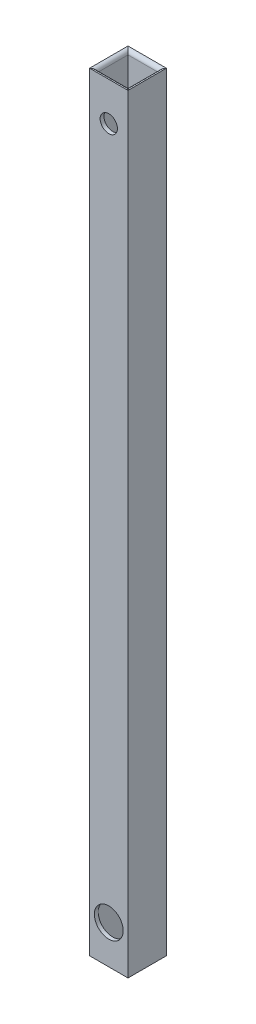
ISO-10303-21;
HEADER;
FILE_DESCRIPTION(('STEP AP214'),'2;1');
FILE_NAME('part.step','',(''),(''),'','','');
FILE_SCHEMA(('AUTOMOTIVE_DESIGN { 1 0 10303 214 1 1 1 1 }'));
ENDSEC;
DATA;
#1=APPLICATION_CONTEXT('core data for automotive mechanical design processes');
#2=APPLICATION_PROTOCOL_DEFINITION('international standard','automotive_design',2000,#1);
#3=PRODUCT_CONTEXT('',#1,'mechanical');
#4=PRODUCT('Part','Part','',(#3));
#5=PRODUCT_RELATED_PRODUCT_CATEGORY('part','',(#4));
#6=PRODUCT_DEFINITION_FORMATION('','',#4);
#7=PRODUCT_DEFINITION_CONTEXT('part definition',#1,'design');
#8=PRODUCT_DEFINITION('design','',#6,#7);
#9=PRODUCT_DEFINITION_SHAPE('','',#8);
#10=(LENGTH_UNIT() NAMED_UNIT(*) SI_UNIT(.MILLI.,.METRE.));
#11=(NAMED_UNIT(*) PLANE_ANGLE_UNIT() SI_UNIT($,.RADIAN.));
#12=(NAMED_UNIT(*) SI_UNIT($,.STERADIAN.) SOLID_ANGLE_UNIT());
#13=UNCERTAINTY_MEASURE_WITH_UNIT(LENGTH_MEASURE(1.E-05),#10,'distance_accuracy_value','');
#14=(GEOMETRIC_REPRESENTATION_CONTEXT(3) GLOBAL_UNCERTAINTY_ASSIGNED_CONTEXT((#13)) GLOBAL_UNIT_ASSIGNED_CONTEXT((#10,
#11,#12)) REPRESENTATION_CONTEXT('',''));
#15=CARTESIAN_POINT('',(0.,0.,0.));
#16=DIRECTION('',(0.,0.,1.));
#17=DIRECTION('',(1.,0.,0.));
#18=AXIS2_PLACEMENT_3D('',#15,#16,#17);
#19=CARTESIAN_POINT('',(5.,200.,-5.));
#20=DIRECTION('',(-1.,0.,0.));
#21=DIRECTION('',(0.,0.,1.));
#22=AXIS2_PLACEMENT_3D('',#19,#20,#21);
#23=PLANE('',#22);
#24=DIRECTION('',(0.,0.,-1.));
#25=VECTOR('',#24,1.);
#26=CARTESIAN_POINT('',(5.,0.,-5.));
#27=LINE('',#26,#25);
#28=CARTESIAN_POINT('',(5.,0.,5.));
#29=VERTEX_POINT('',#28);
#30=CARTESIAN_POINT('',(5.,0.,-5.));
#31=VERTEX_POINT('',#30);
#32=EDGE_CURVE('E122',#29,#31,#27,.T.);
#33=ORIENTED_EDGE('',*,*,#32,.T.);
#34=DIRECTION('',(0.,-1.,0.));
#35=VECTOR('',#34,1.);
#36=CARTESIAN_POINT('',(5.,200.,-5.));
#37=LINE('',#36,#35);
#38=CARTESIAN_POINT('',(5.,200.,-5.));
#39=VERTEX_POINT('',#38);
#40=EDGE_CURVE('E108',#39,#31,#37,.T.);
#41=ORIENTED_EDGE('',*,*,#40,.F.);
#42=DIRECTION('',(0.,0.,-1.));
#43=VECTOR('',#42,1.);
#44=CARTESIAN_POINT('',(5.,200.,-5.));
#45=LINE('',#44,#43);
#46=CARTESIAN_POINT('',(5.,200.,5.));
#47=VERTEX_POINT('',#46);
#48=EDGE_CURVE('E116',#47,#39,#45,.T.);
#49=ORIENTED_EDGE('',*,*,#48,.F.);
#50=DIRECTION('',(0.,-1.,0.));
#51=VECTOR('',#50,1.);
#52=CARTESIAN_POINT('',(5.,200.,5.));
#53=LINE('',#52,#51);
#54=EDGE_CURVE('E184',#47,#29,#53,.T.);
#55=ORIENTED_EDGE('',*,*,#54,.T.);
#56=EDGE_LOOP('',(#33,#41,#49,#55));
#57=FACE_BOUND('',#56,.T.);
#58=ADVANCED_FACE('F37',(#57),#23,.F.);
#59=CARTESIAN_POINT('',(-5.,200.,-5.));
#60=DIRECTION('',(0.,0.,1.));
#61=DIRECTION('',(1.,0.,0.));
#62=AXIS2_PLACEMENT_3D('',#59,#60,#61);
#63=PLANE('',#62);
#64=CARTESIAN_POINT('',(0.,10.,-5.));
#65=DIRECTION('',(0.,0.,1.));
#66=DIRECTION('',(1.,0.,0.));
#67=AXIS2_PLACEMENT_3D('',#64,#65,#66);
#68=CIRCLE('',#67,3.75);
#69=CARTESIAN_POINT('',(3.75,10.,-5.));
#70=VERTEX_POINT('',#69);
#71=EDGE_CURVE('E151',#70,#70,#68,.T.);
#72=ORIENTED_EDGE('',*,*,#71,.T.);
#73=EDGE_LOOP('',(#72));
#74=FACE_BOUND('',#73,.T.);
#75=CARTESIAN_POINT('',(0.,190.,-5.));
#76=DIRECTION('',(0.,0.,1.));
#77=DIRECTION('',(1.,0.,0.));
#78=AXIS2_PLACEMENT_3D('',#75,#76,#77);
#79=CIRCLE('',#78,2.25);
#80=CARTESIAN_POINT('',(2.25,190.,-5.));
#81=VERTEX_POINT('',#80);
#82=EDGE_CURVE('E167',#81,#81,#79,.T.);
#83=ORIENTED_EDGE('',*,*,#82,.T.);
#84=EDGE_LOOP('',(#83));
#85=FACE_BOUND('',#84,.T.);
#86=DIRECTION('',(-1.,0.,0.));
#87=VECTOR('',#86,1.);
#88=CARTESIAN_POINT('',(-5.,0.,-5.));
#89=LINE('',#88,#87);
#90=CARTESIAN_POINT('',(-5.,0.,-5.));
#91=VERTEX_POINT('',#90);
#92=EDGE_CURVE('E186',#31,#91,#89,.T.);
#93=ORIENTED_EDGE('',*,*,#92,.T.);
#94=DIRECTION('',(0.,-1.,0.));
#95=VECTOR('',#94,1.);
#96=CARTESIAN_POINT('',(-5.,200.,-5.));
#97=LINE('',#96,#95);
#98=CARTESIAN_POINT('',(-5.,200.,-5.));
#99=VERTEX_POINT('',#98);
#100=EDGE_CURVE('E111',#99,#91,#97,.T.);
#101=ORIENTED_EDGE('',*,*,#100,.F.);
#102=DIRECTION('',(-1.,0.,0.));
#103=VECTOR('',#102,1.);
#104=CARTESIAN_POINT('',(-5.,200.,-5.));
#105=LINE('',#104,#103);
#106=EDGE_CURVE('E105',#39,#99,#105,.T.);
#107=ORIENTED_EDGE('',*,*,#106,.F.);
#108=ORIENTED_EDGE('',*,*,#40,.T.);
#109=EDGE_LOOP('',(#93,#101,#107,#108));
#110=FACE_BOUND('',#109,.T.);
#111=ADVANCED_FACE('F107',(#74,#85,#110),#63,.F.);
#112=CARTESIAN_POINT('',(-5.,200.,-5.));
#113=DIRECTION('',(1.,0.,0.));
#114=DIRECTION('',(0.,0.,-1.));
#115=AXIS2_PLACEMENT_3D('',#112,#113,#114);
#116=PLANE('',#115);
#117=DIRECTION('',(0.,0.,1.));
#118=VECTOR('',#117,1.);
#119=CARTESIAN_POINT('',(-5.,0.,-5.));
#120=LINE('',#119,#118);
#121=CARTESIAN_POINT('',(-5.,0.,5.));
#122=VERTEX_POINT('',#121);
#123=EDGE_CURVE('E188',#91,#122,#120,.T.);
#124=ORIENTED_EDGE('',*,*,#123,.T.);
#125=DIRECTION('',(0.,-1.,0.));
#126=VECTOR('',#125,1.);
#127=CARTESIAN_POINT('',(-5.,200.,5.));
#128=LINE('',#127,#126);
#129=CARTESIAN_POINT('',(-5.,200.,5.));
#130=VERTEX_POINT('',#129);
#131=EDGE_CURVE('E193',#130,#122,#128,.T.);
#132=ORIENTED_EDGE('',*,*,#131,.F.);
#133=DIRECTION('',(0.,0.,1.));
#134=VECTOR('',#133,1.);
#135=CARTESIAN_POINT('',(-5.,200.,-5.));
#136=LINE('',#135,#134);
#137=EDGE_CURVE('E115',#99,#130,#136,.T.);
#138=ORIENTED_EDGE('',*,*,#137,.F.);
#139=ORIENTED_EDGE('',*,*,#100,.T.);
#140=EDGE_LOOP('',(#124,#132,#138,#139));
#141=FACE_BOUND('',#140,.T.);
#142=ADVANCED_FACE('F247',(#141),#116,.F.);
#143=CARTESIAN_POINT('',(-5.,200.,5.));
#144=DIRECTION('',(0.,0.,-1.));
#145=DIRECTION('',(-1.,0.,0.));
#146=AXIS2_PLACEMENT_3D('',#143,#144,#145);
#147=PLANE('',#146);
#148=CARTESIAN_POINT('',(0.,10.,5.));
#149=DIRECTION('',(0.,0.,1.));
#150=DIRECTION('',(1.,0.,0.));
#151=AXIS2_PLACEMENT_3D('',#148,#149,#150);
#152=CIRCLE('',#151,3.75);
#153=CARTESIAN_POINT('',(3.75,10.,5.));
#154=VERTEX_POINT('',#153);
#155=EDGE_CURVE('E157',#154,#154,#152,.T.);
#156=ORIENTED_EDGE('',*,*,#155,.F.);
#157=EDGE_LOOP('',(#156));
#158=FACE_BOUND('',#157,.T.);
#159=CARTESIAN_POINT('',(0.,190.,5.));
#160=DIRECTION('',(0.,0.,1.));
#161=DIRECTION('',(1.,0.,0.));
#162=AXIS2_PLACEMENT_3D('',#159,#160,#161);
#163=CIRCLE('',#162,2.25);
#164=CARTESIAN_POINT('',(2.25,190.,5.));
#165=VERTEX_POINT('',#164);
#166=EDGE_CURVE('E162',#165,#165,#163,.T.);
#167=ORIENTED_EDGE('',*,*,#166,.F.);
#168=EDGE_LOOP('',(#167));
#169=FACE_BOUND('',#168,.T.);
#170=DIRECTION('',(1.,0.,0.));
#171=VECTOR('',#170,1.);
#172=CARTESIAN_POINT('',(-5.,0.,5.));
#173=LINE('',#172,#171);
#174=EDGE_CURVE('E130',#122,#29,#173,.T.);
#175=ORIENTED_EDGE('',*,*,#174,.T.);
#176=ORIENTED_EDGE('',*,*,#54,.F.);
#177=DIRECTION('',(1.,0.,0.));
#178=VECTOR('',#177,1.);
#179=CARTESIAN_POINT('',(-5.,200.,5.));
#180=LINE('',#179,#178);
#181=EDGE_CURVE('E182',#130,#47,#180,.T.);
#182=ORIENTED_EDGE('',*,*,#181,.F.);
#183=ORIENTED_EDGE('',*,*,#131,.T.);
#184=EDGE_LOOP('',(#175,#176,#182,#183));
#185=FACE_BOUND('',#184,.T.);
#186=ADVANCED_FACE('F250',(#158,#169,#185),#147,.F.);
#187=CARTESIAN_POINT('',(4.,200.,-4.));
#188=DIRECTION('',(-1.,0.,0.));
#189=DIRECTION('',(0.,0.,1.));
#190=AXIS2_PLACEMENT_3D('',#187,#188,#189);
#191=PLANE('',#190);
#192=DIRECTION('',(0.,-1.,0.));
#193=VECTOR('',#192,1.);
#194=CARTESIAN_POINT('',(4.,200.,-4.));
#195=LINE('',#194,#193);
#196=CARTESIAN_POINT('',(4.,199.,-4.));
#197=VERTEX_POINT('',#196);
#198=CARTESIAN_POINT('',(4.,1.,-4.));
#199=VERTEX_POINT('',#198);
#200=EDGE_CURVE('E178',#197,#199,#195,.T.);
#201=ORIENTED_EDGE('',*,*,#200,.T.);
#202=DIRECTION('',(0.,0.,-1.));
#203=VECTOR('',#202,1.);
#204=CARTESIAN_POINT('',(4.,1.,4.));
#205=LINE('',#204,#203);
#206=CARTESIAN_POINT('',(4.,1.,4.));
#207=VERTEX_POINT('',#206);
#208=EDGE_CURVE('E207',#199,#207,#205,.F.);
#209=ORIENTED_EDGE('',*,*,#208,.T.);
#210=DIRECTION('',(0.,-1.,0.));
#211=VECTOR('',#210,1.);
#212=CARTESIAN_POINT('',(4.,200.,4.));
#213=LINE('',#212,#211);
#214=CARTESIAN_POINT('',(4.,199.,4.));
#215=VERTEX_POINT('',#214);
#216=EDGE_CURVE('E170',#215,#207,#213,.T.);
#217=ORIENTED_EDGE('',*,*,#216,.F.);
#218=DIRECTION('',(0.,0.,-1.));
#219=VECTOR('',#218,1.);
#220=CARTESIAN_POINT('',(4.,199.,-4.));
#221=LINE('',#220,#219);
#222=EDGE_CURVE('E205',#215,#197,#221,.T.);
#223=ORIENTED_EDGE('',*,*,#222,.T.);
#224=EDGE_LOOP('',(#201,#209,#217,#223));
#225=FACE_BOUND('',#224,.T.);
#226=ADVANCED_FACE('F228',(#225),#191,.T.);
#227=CARTESIAN_POINT('',(-4.,200.,-4.));
#228=DIRECTION('',(0.,0.,1.));
#229=DIRECTION('',(1.,0.,0.));
#230=AXIS2_PLACEMENT_3D('',#227,#228,#229);
#231=PLANE('',#230);
#232=CARTESIAN_POINT('',(0.,10.,-4.));
#233=DIRECTION('',(0.,0.,1.));
#234=DIRECTION('',(1.,0.,0.));
#235=AXIS2_PLACEMENT_3D('',#232,#233,#234);
#236=CIRCLE('',#235,3.75);
#237=CARTESIAN_POINT('',(3.75,10.,-4.));
#238=VERTEX_POINT('',#237);
#239=EDGE_CURVE('E134',#238,#238,#236,.T.);
#240=ORIENTED_EDGE('',*,*,#239,.F.);
#241=EDGE_LOOP('',(#240));
#242=FACE_BOUND('',#241,.T.);
#243=CARTESIAN_POINT('',(0.,190.,-4.));
#244=DIRECTION('',(0.,0.,1.));
#245=DIRECTION('',(1.,0.,0.));
#246=AXIS2_PLACEMENT_3D('',#243,#244,#245);
#247=CIRCLE('',#246,2.25);
#248=CARTESIAN_POINT('',(2.25,190.,-4.));
#249=VERTEX_POINT('',#248);
#250=EDGE_CURVE('E150',#249,#249,#247,.T.);
#251=ORIENTED_EDGE('',*,*,#250,.F.);
#252=EDGE_LOOP('',(#251));
#253=FACE_BOUND('',#252,.T.);
#254=DIRECTION('',(0.,-1.,0.));
#255=VECTOR('',#254,1.);
#256=CARTESIAN_POINT('',(-4.,200.,-4.));
#257=LINE('',#256,#255);
#258=CARTESIAN_POINT('',(-4.,199.,-4.));
#259=VERTEX_POINT('',#258);
#260=CARTESIAN_POINT('',(-4.,1.,-4.));
#261=VERTEX_POINT('',#260);
#262=EDGE_CURVE('E176',#259,#261,#257,.T.);
#263=ORIENTED_EDGE('',*,*,#262,.T.);
#264=DIRECTION('',(-1.,0.,0.));
#265=VECTOR('',#264,1.);
#266=CARTESIAN_POINT('',(4.,1.,-4.));
#267=LINE('',#266,#265);
#268=EDGE_CURVE('E11',#261,#199,#267,.F.);
#269=ORIENTED_EDGE('',*,*,#268,.T.);
#270=ORIENTED_EDGE('',*,*,#200,.F.);
#271=DIRECTION('',(-1.,0.,0.));
#272=VECTOR('',#271,1.);
#273=CARTESIAN_POINT('',(-4.,199.,-4.));
#274=LINE('',#273,#272);
#275=EDGE_CURVE('E46',#197,#259,#274,.T.);
#276=ORIENTED_EDGE('',*,*,#275,.T.);
#277=EDGE_LOOP('',(#263,#269,#270,#276));
#278=FACE_BOUND('',#277,.T.);
#279=ADVANCED_FACE('F238',(#242,#253,#278),#231,.T.);
#280=CARTESIAN_POINT('',(-4.,200.,-4.));
#281=DIRECTION('',(1.,0.,0.));
#282=DIRECTION('',(0.,0.,-1.));
#283=AXIS2_PLACEMENT_3D('',#280,#281,#282);
#284=PLANE('',#283);
#285=DIRECTION('',(0.,-1.,0.));
#286=VECTOR('',#285,1.);
#287=CARTESIAN_POINT('',(-4.,200.,4.));
#288=LINE('',#287,#286);
#289=CARTESIAN_POINT('',(-4.,199.,4.));
#290=VERTEX_POINT('',#289);
#291=CARTESIAN_POINT('',(-4.,1.,4.));
#292=VERTEX_POINT('',#291);
#293=EDGE_CURVE('E173',#290,#292,#288,.T.);
#294=ORIENTED_EDGE('',*,*,#293,.T.);
#295=DIRECTION('',(0.,0.,1.));
#296=VECTOR('',#295,1.);
#297=CARTESIAN_POINT('',(-4.,1.,-4.));
#298=LINE('',#297,#296);
#299=EDGE_CURVE('E198',#292,#261,#298,.F.);
#300=ORIENTED_EDGE('',*,*,#299,.T.);
#301=ORIENTED_EDGE('',*,*,#262,.F.);
#302=DIRECTION('',(0.,0.,1.));
#303=VECTOR('',#302,1.);
#304=CARTESIAN_POINT('',(-4.,199.,-4.));
#305=LINE('',#304,#303);
#306=EDGE_CURVE('E124',#259,#290,#305,.T.);
#307=ORIENTED_EDGE('',*,*,#306,.T.);
#308=EDGE_LOOP('',(#294,#300,#301,#307));
#309=FACE_BOUND('',#308,.T.);
#310=ADVANCED_FACE('F242',(#309),#284,.T.);
#311=CARTESIAN_POINT('',(-4.,200.,4.));
#312=DIRECTION('',(0.,0.,-1.));
#313=DIRECTION('',(-1.,0.,0.));
#314=AXIS2_PLACEMENT_3D('',#311,#312,#313);
#315=PLANE('',#314);
#316=CARTESIAN_POINT('',(0.,10.,4.));
#317=DIRECTION('',(0.,0.,-1.));
#318=DIRECTION('',(-1.,0.,0.));
#319=AXIS2_PLACEMENT_3D('',#316,#317,#318);
#320=CIRCLE('',#319,3.75);
#321=CARTESIAN_POINT('',(-3.75,10.,4.));
#322=VERTEX_POINT('',#321);
#323=EDGE_CURVE('E41',#322,#322,#320,.T.);
#324=ORIENTED_EDGE('',*,*,#323,.F.);
#325=EDGE_LOOP('',(#324));
#326=FACE_BOUND('',#325,.T.);
#327=CARTESIAN_POINT('',(0.,190.,4.));
#328=DIRECTION('',(0.,0.,-1.));
#329=DIRECTION('',(-1.,0.,0.));
#330=AXIS2_PLACEMENT_3D('',#327,#328,#329);
#331=CIRCLE('',#330,2.25);
#332=CARTESIAN_POINT('',(-2.25,190.,4.));
#333=VERTEX_POINT('',#332);
#334=EDGE_CURVE('E148',#333,#333,#331,.T.);
#335=ORIENTED_EDGE('',*,*,#334,.F.);
#336=EDGE_LOOP('',(#335));
#337=FACE_BOUND('',#336,.T.);
#338=ORIENTED_EDGE('',*,*,#216,.T.);
#339=DIRECTION('',(1.,0.,0.));
#340=VECTOR('',#339,1.);
#341=CARTESIAN_POINT('',(-4.,1.,4.));
#342=LINE('',#341,#340);
#343=EDGE_CURVE('E203',#207,#292,#342,.F.);
#344=ORIENTED_EDGE('',*,*,#343,.T.);
#345=ORIENTED_EDGE('',*,*,#293,.F.);
#346=DIRECTION('',(1.,0.,0.));
#347=VECTOR('',#346,1.);
#348=CARTESIAN_POINT('',(-4.,199.,4.));
#349=LINE('',#348,#347);
#350=EDGE_CURVE('E201',#290,#215,#349,.T.);
#351=ORIENTED_EDGE('',*,*,#350,.T.);
#352=EDGE_LOOP('',(#338,#344,#345,#351));
#353=FACE_BOUND('',#352,.T.);
#354=ADVANCED_FACE('F230',(#326,#337,#353),#315,.T.);
#355=CARTESIAN_POINT('',(5.,1.,0.));
#356=DIRECTION('',(0.,0.,1.));
#357=DIRECTION('',(1.,0.,0.));
#358=AXIS2_PLACEMENT_3D('',#355,#356,#357);
#359=CYLINDRICAL_SURFACE('',#358,1.);
#360=CARTESIAN_POINT('',(5.,1.,5.));
#361=DIRECTION('',(-0.707106781186547,0.,0.707106781186548));
#362=DIRECTION('',(-0.707106781186547,0.,-0.707106781186547));
#363=AXIS2_PLACEMENT_3D('',#360,#361,#362);
#364=ELLIPSE('',#363,1.4142135623731,1.);
#365=EDGE_CURVE('E212',#207,#29,#364,.T.);
#366=ORIENTED_EDGE('',*,*,#365,.F.);
#367=ORIENTED_EDGE('',*,*,#208,.F.);
#368=CARTESIAN_POINT('',(5.,1.,-5.));
#369=DIRECTION('',(0.707106781186547,0.,0.707106781186547));
#370=DIRECTION('',(-0.707106781186547,0.,0.707106781186548));
#371=AXIS2_PLACEMENT_3D('',#368,#369,#370);
#372=ELLIPSE('',#371,1.41421356237309,1.);
#373=EDGE_CURVE('E141',#31,#199,#372,.F.);
#374=ORIENTED_EDGE('',*,*,#373,.F.);
#375=ORIENTED_EDGE('',*,*,#32,.F.);
#376=EDGE_LOOP('',(#366,#367,#374,#375));
#377=FACE_BOUND('',#376,.T.);
#378=ADVANCED_FACE('F225',(#377),#359,.T.);
#379=CARTESIAN_POINT('',(0.,1.,-5.));
#380=DIRECTION('',(1.,0.,0.));
#381=DIRECTION('',(0.,0.,-1.));
#382=AXIS2_PLACEMENT_3D('',#379,#380,#381);
#383=CYLINDRICAL_SURFACE('',#382,1.);
#384=ORIENTED_EDGE('',*,*,#373,.T.);
#385=ORIENTED_EDGE('',*,*,#268,.F.);
#386=CARTESIAN_POINT('',(-5.,1.,-5.));
#387=DIRECTION('',(0.707106781186547,0.,-0.707106781186547));
#388=DIRECTION('',(-0.707106781186547,0.,-0.707106781186547));
#389=AXIS2_PLACEMENT_3D('',#386,#387,#388);
#390=ELLIPSE('',#389,1.41421356237309,1.);
#391=EDGE_CURVE('E211',#91,#261,#390,.F.);
#392=ORIENTED_EDGE('',*,*,#391,.F.);
#393=ORIENTED_EDGE('',*,*,#92,.F.);
#394=EDGE_LOOP('',(#384,#385,#392,#393));
#395=FACE_BOUND('',#394,.T.);
#396=ADVANCED_FACE('F221',(#395),#383,.T.);
#397=CARTESIAN_POINT('',(0.,1.,5.));
#398=DIRECTION('',(-1.,0.,0.));
#399=DIRECTION('',(0.,0.,1.));
#400=AXIS2_PLACEMENT_3D('',#397,#398,#399);
#401=CYLINDRICAL_SURFACE('',#400,1.);
#402=ORIENTED_EDGE('',*,*,#365,.T.);
#403=ORIENTED_EDGE('',*,*,#174,.F.);
#404=CARTESIAN_POINT('',(-5.,1.,5.));
#405=DIRECTION('',(-0.707106781186547,0.,-0.707106781186547));
#406=DIRECTION('',(0.707106781186547,0.,-0.707106781186547));
#407=AXIS2_PLACEMENT_3D('',#404,#405,#406);
#408=ELLIPSE('',#407,1.41421356237309,1.);
#409=EDGE_CURVE('E147',#292,#122,#408,.T.);
#410=ORIENTED_EDGE('',*,*,#409,.F.);
#411=ORIENTED_EDGE('',*,*,#343,.F.);
#412=EDGE_LOOP('',(#402,#403,#410,#411));
#413=FACE_BOUND('',#412,.T.);
#414=ADVANCED_FACE('F252',(#413),#401,.T.);
#415=CARTESIAN_POINT('',(-5.,1.,0.));
#416=DIRECTION('',(0.,0.,-1.));
#417=DIRECTION('',(-1.,0.,0.));
#418=AXIS2_PLACEMENT_3D('',#415,#416,#417);
#419=CYLINDRICAL_SURFACE('',#418,1.);
#420=ORIENTED_EDGE('',*,*,#391,.T.);
#421=ORIENTED_EDGE('',*,*,#299,.F.);
#422=ORIENTED_EDGE('',*,*,#409,.T.);
#423=ORIENTED_EDGE('',*,*,#123,.F.);
#424=EDGE_LOOP('',(#420,#421,#422,#423));
#425=FACE_BOUND('',#424,.T.);
#426=ADVANCED_FACE('F254',(#425),#419,.T.);
#427=CARTESIAN_POINT('',(-5.,199.,-4.));
#428=DIRECTION('',(0.,0.,1.));
#429=DIRECTION('',(1.,0.,0.));
#430=AXIS2_PLACEMENT_3D('',#427,#428,#429);
#431=CYLINDRICAL_SURFACE('',#430,1.);
#432=CARTESIAN_POINT('',(-5.,199.,-5.));
#433=DIRECTION('',(-0.707106781186547,0.,0.707106781186547));
#434=DIRECTION('',(-0.707106781186547,0.,-0.707106781186547));
#435=AXIS2_PLACEMENT_3D('',#432,#433,#434);
#436=ELLIPSE('',#435,1.41421356237309,1.);
#437=EDGE_CURVE('E136',#99,#259,#436,.F.);
#438=ORIENTED_EDGE('',*,*,#437,.F.);
#439=ORIENTED_EDGE('',*,*,#137,.T.);
#440=CARTESIAN_POINT('',(-5.,199.,5.));
#441=DIRECTION('',(0.707106781186547,0.,0.707106781186547));
#442=DIRECTION('',(-0.707106781186547,0.,0.707106781186547));
#443=AXIS2_PLACEMENT_3D('',#440,#441,#442);
#444=ELLIPSE('',#443,1.41421356237309,1.);
#445=EDGE_CURVE('E145',#290,#130,#444,.T.);
#446=ORIENTED_EDGE('',*,*,#445,.F.);
#447=ORIENTED_EDGE('',*,*,#306,.F.);
#448=EDGE_LOOP('',(#438,#439,#446,#447));
#449=FACE_BOUND('',#448,.T.);
#450=ADVANCED_FACE('F39',(#449),#431,.T.);
#451=CARTESIAN_POINT('',(-4.,199.,5.));
#452=DIRECTION('',(1.,0.,0.));
#453=DIRECTION('',(0.,0.,-1.));
#454=AXIS2_PLACEMENT_3D('',#451,#452,#453);
#455=CYLINDRICAL_SURFACE('',#454,1.);
#456=ORIENTED_EDGE('',*,*,#445,.T.);
#457=ORIENTED_EDGE('',*,*,#181,.T.);
#458=CARTESIAN_POINT('',(5.,199.,5.));
#459=DIRECTION('',(0.707106781186547,0.,-0.707106781186548));
#460=DIRECTION('',(-0.707106781186547,0.,-0.707106781186547));
#461=AXIS2_PLACEMENT_3D('',#458,#459,#460);
#462=ELLIPSE('',#461,1.4142135623731,1.);
#463=EDGE_CURVE('E128',#215,#47,#462,.T.);
#464=ORIENTED_EDGE('',*,*,#463,.F.);
#465=ORIENTED_EDGE('',*,*,#350,.F.);
#466=EDGE_LOOP('',(#456,#457,#464,#465));
#467=FACE_BOUND('',#466,.T.);
#468=ADVANCED_FACE('F235',(#467),#455,.T.);
#469=CARTESIAN_POINT('',(-4.,199.,-5.));
#470=DIRECTION('',(-1.,0.,0.));
#471=DIRECTION('',(0.,0.,1.));
#472=AXIS2_PLACEMENT_3D('',#469,#470,#471);
#473=CYLINDRICAL_SURFACE('',#472,1.);
#474=ORIENTED_EDGE('',*,*,#437,.T.);
#475=ORIENTED_EDGE('',*,*,#275,.F.);
#476=CARTESIAN_POINT('',(5.,199.,-5.));
#477=DIRECTION('',(-0.707106781186547,0.,-0.707106781186547));
#478=DIRECTION('',(0.707106781186547,0.,-0.707106781186548));
#479=AXIS2_PLACEMENT_3D('',#476,#477,#478);
#480=ELLIPSE('',#479,1.41421356237309,1.);
#481=EDGE_CURVE('E60',#39,#197,#480,.F.);
#482=ORIENTED_EDGE('',*,*,#481,.F.);
#483=ORIENTED_EDGE('',*,*,#106,.T.);
#484=EDGE_LOOP('',(#474,#475,#482,#483));
#485=FACE_BOUND('',#484,.T.);
#486=ADVANCED_FACE('F132',(#485),#473,.T.);
#487=CARTESIAN_POINT('',(5.,199.,-4.));
#488=DIRECTION('',(0.,0.,-1.));
#489=DIRECTION('',(-1.,0.,0.));
#490=AXIS2_PLACEMENT_3D('',#487,#488,#489);
#491=CYLINDRICAL_SURFACE('',#490,1.);
#492=ORIENTED_EDGE('',*,*,#463,.T.);
#493=ORIENTED_EDGE('',*,*,#48,.T.);
#494=ORIENTED_EDGE('',*,*,#481,.T.);
#495=ORIENTED_EDGE('',*,*,#222,.F.);
#496=EDGE_LOOP('',(#492,#493,#494,#495));
#497=FACE_BOUND('',#496,.T.);
#498=ADVANCED_FACE('F126',(#497),#491,.T.);
#499=CARTESIAN_POINT('',(0.,190.,-5.));
#500=DIRECTION('',(0.,0.,1.));
#501=DIRECTION('',(1.,0.,0.));
#502=AXIS2_PLACEMENT_3D('',#499,#500,#501);
#503=CYLINDRICAL_SURFACE('',#502,2.25);
#504=ORIENTED_EDGE('',*,*,#334,.T.);
#505=EDGE_LOOP('',(#504));
#506=FACE_BOUND('',#505,.T.);
#507=ORIENTED_EDGE('',*,*,#166,.T.);
#508=EDGE_LOOP('',(#507));
#509=FACE_BOUND('',#508,.T.);
#510=ADVANCED_FACE('F284',(#506,#509),#503,.F.);
#511=CARTESIAN_POINT('',(0.,10.,-5.));
#512=DIRECTION('',(0.,0.,1.));
#513=DIRECTION('',(1.,0.,0.));
#514=AXIS2_PLACEMENT_3D('',#511,#512,#513);
#515=CYLINDRICAL_SURFACE('',#514,3.75);
#516=ORIENTED_EDGE('',*,*,#323,.T.);
#517=EDGE_LOOP('',(#516));
#518=FACE_BOUND('',#517,.T.);
#519=ORIENTED_EDGE('',*,*,#155,.T.);
#520=EDGE_LOOP('',(#519));
#521=FACE_BOUND('',#520,.T.);
#522=ADVANCED_FACE('F287',(#518,#521),#515,.F.);
#523=ORIENTED_EDGE('',*,*,#250,.T.);
#524=EDGE_LOOP('',(#523));
#525=FACE_BOUND('',#524,.T.);
#526=ORIENTED_EDGE('',*,*,#82,.F.);
#527=EDGE_LOOP('',(#526));
#528=FACE_BOUND('',#527,.T.);
#529=ADVANCED_FACE('F288',(#525,#528),#503,.F.);
#530=ORIENTED_EDGE('',*,*,#239,.T.);
#531=EDGE_LOOP('',(#530));
#532=FACE_BOUND('',#531,.T.);
#533=ORIENTED_EDGE('',*,*,#71,.F.);
#534=EDGE_LOOP('',(#533));
#535=FACE_BOUND('',#534,.T.);
#536=ADVANCED_FACE('F291',(#532,#535),#515,.F.);
#537=CLOSED_SHELL('',(#58,#111,#142,#186,#226,#279,#310,#354,#378,#396,#414,#426,#450,#468,#486,
#498,#510,#522,#529,#536));
#538=MANIFOLD_SOLID_BREP('B2',#537);
#539=ADVANCED_BREP_SHAPE_REPRESENTATION('',(#18,#538),#14);
#540=SHAPE_DEFINITION_REPRESENTATION(#9,#539);
ENDSEC;
END-ISO-10303-21;
